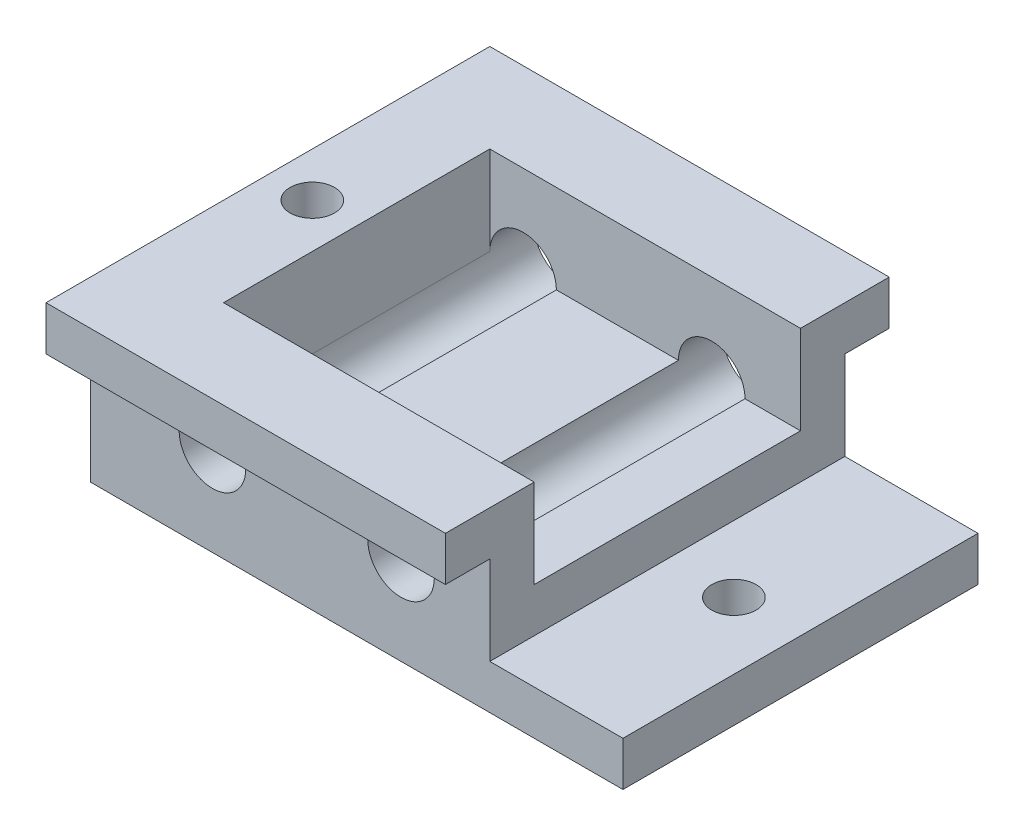
ISO-10303-21;
HEADER;
FILE_DESCRIPTION(('STEP AP214'),'2;1');
FILE_NAME('part.step','',(''),(''),'','','');
FILE_SCHEMA(('AUTOMOTIVE_DESIGN { 1 0 10303 214 1 1 1 1 }'));
ENDSEC;
DATA;
#1=APPLICATION_CONTEXT('core data for automotive mechanical design processes');
#2=APPLICATION_PROTOCOL_DEFINITION('international standard','automotive_design',2000,#1);
#3=PRODUCT_CONTEXT('',#1,'mechanical');
#4=PRODUCT('Part','Part','',(#3));
#5=PRODUCT_RELATED_PRODUCT_CATEGORY('part','',(#4));
#6=PRODUCT_DEFINITION_FORMATION('','',#4);
#7=PRODUCT_DEFINITION_CONTEXT('part definition',#1,'design');
#8=PRODUCT_DEFINITION('design','',#6,#7);
#9=PRODUCT_DEFINITION_SHAPE('','',#8);
#10=(LENGTH_UNIT() NAMED_UNIT(*) SI_UNIT(.MILLI.,.METRE.));
#11=(NAMED_UNIT(*) PLANE_ANGLE_UNIT() SI_UNIT($,.RADIAN.));
#12=(NAMED_UNIT(*) SI_UNIT($,.STERADIAN.) SOLID_ANGLE_UNIT());
#13=UNCERTAINTY_MEASURE_WITH_UNIT(LENGTH_MEASURE(1.E-05),#10,'distance_accuracy_value','');
#14=(GEOMETRIC_REPRESENTATION_CONTEXT(3) GLOBAL_UNCERTAINTY_ASSIGNED_CONTEXT((#13)) GLOBAL_UNIT_ASSIGNED_CONTEXT((#10,
#11,#12)) REPRESENTATION_CONTEXT('',''));
#15=CARTESIAN_POINT('',(0.,0.,0.));
#16=DIRECTION('',(0.,0.,1.));
#17=DIRECTION('',(1.,0.,0.));
#18=AXIS2_PLACEMENT_3D('',#15,#16,#17);
#19=CARTESIAN_POINT('',(0.,12.7,0.));
#20=DIRECTION('',(0.,1.,0.));
#21=DIRECTION('',(0.,0.,1.));
#22=AXIS2_PLACEMENT_3D('',#19,#20,#21);
#23=PLANE('',#22);
#24=DIRECTION('',(0.,0.,1.));
#25=VECTOR('',#24,1.);
#26=CARTESIAN_POINT('',(-15.875,12.7,-31.75));
#27=LINE('',#26,#25);
#28=CARTESIAN_POINT('',(-15.875,12.7,19.05));
#29=VERTEX_POINT('',#28);
#30=CARTESIAN_POINT('',(-15.875,12.7,-19.05));
#31=VERTEX_POINT('',#30);
#32=EDGE_CURVE('E64',#29,#31,#27,.F.);
#33=ORIENTED_EDGE('',*,*,#32,.F.);
#34=DIRECTION('',(-1.,0.,0.));
#35=VECTOR('',#34,1.);
#36=CARTESIAN_POINT('',(19.05,12.7,19.05));
#37=LINE('',#36,#35);
#38=CARTESIAN_POINT('',(1.5875,12.7,19.05));
#39=VERTEX_POINT('',#38);
#40=EDGE_CURVE('E171',#39,#29,#37,.T.);
#41=ORIENTED_EDGE('',*,*,#40,.F.);
#42=DIRECTION('',(0.,0.,1.));
#43=VECTOR('',#42,1.);
#44=CARTESIAN_POINT('',(1.5875,12.7,-31.75));
#45=LINE('',#44,#43);
#46=CARTESIAN_POINT('',(1.5875,12.7,-19.05));
#47=VERTEX_POINT('',#46);
#48=EDGE_CURVE('E159',#47,#39,#45,.T.);
#49=ORIENTED_EDGE('',*,*,#48,.F.);
#50=DIRECTION('',(1.,0.,0.));
#51=VECTOR('',#50,1.);
#52=CARTESIAN_POINT('',(-25.4,12.7,-19.05));
#53=LINE('',#52,#51);
#54=EDGE_CURVE('E169',#31,#47,#53,.T.);
#55=ORIENTED_EDGE('',*,*,#54,.F.);
#56=EDGE_LOOP('',(#33,#41,#49,#55));
#57=FACE_BOUND('',#56,.T.);
#58=ADVANCED_FACE('F40',(#57),#23,.T.);
#59=CARTESIAN_POINT('',(0.,6.35,0.));
#60=DIRECTION('',(0.,-1.,0.));
#61=DIRECTION('',(0.,0.,-1.));
#62=AXIS2_PLACEMENT_3D('',#59,#60,#61);
#63=PLANE('',#62);
#64=CARTESIAN_POINT('',(28.575,6.35,0.));
#65=DIRECTION('',(0.,-1.,0.));
#66=DIRECTION('',(0.,0.,-1.));
#67=AXIS2_PLACEMENT_3D('',#64,#65,#66);
#68=CIRCLE('',#67,3.175);
#69=CARTESIAN_POINT('',(28.575,6.35,-3.175));
#70=VERTEX_POINT('',#69);
#71=EDGE_CURVE('E343',#70,#70,#68,.F.);
#72=ORIENTED_EDGE('',*,*,#71,.F.);
#73=EDGE_LOOP('',(#72));
#74=FACE_BOUND('',#73,.T.);
#75=DIRECTION('',(0.,0.,-1.));
#76=VECTOR('',#75,1.);
#77=CARTESIAN_POINT('',(19.05,6.35,-25.4));
#78=LINE('',#77,#76);
#79=CARTESIAN_POINT('',(19.05,6.35,25.4));
#80=VERTEX_POINT('',#79);
#81=CARTESIAN_POINT('',(19.05,6.35,-25.4));
#82=VERTEX_POINT('',#81);
#83=EDGE_CURVE('E206',#80,#82,#78,.T.);
#84=ORIENTED_EDGE('',*,*,#83,.F.);
#85=DIRECTION('',(1.,0.,0.));
#86=VECTOR('',#85,1.);
#87=CARTESIAN_POINT('',(-38.1,6.35,25.4));
#88=LINE('',#87,#86);
#89=CARTESIAN_POINT('',(38.1,6.35,25.4));
#90=VERTEX_POINT('',#89);
#91=EDGE_CURVE('E223',#80,#90,#88,.T.);
#92=ORIENTED_EDGE('',*,*,#91,.T.);
#93=DIRECTION('',(0.,0.,-1.));
#94=VECTOR('',#93,1.);
#95=CARTESIAN_POINT('',(38.1,6.35,25.4));
#96=LINE('',#95,#94);
#97=CARTESIAN_POINT('',(38.1,6.35,-25.4));
#98=VERTEX_POINT('',#97);
#99=EDGE_CURVE('E226',#90,#98,#96,.T.);
#100=ORIENTED_EDGE('',*,*,#99,.T.);
#101=DIRECTION('',(-1.,0.,0.));
#102=VECTOR('',#101,1.);
#103=CARTESIAN_POINT('',(-38.1,6.35,-25.4));
#104=LINE('',#103,#102);
#105=EDGE_CURVE('E230',#98,#82,#104,.T.);
#106=ORIENTED_EDGE('',*,*,#105,.T.);
#107=EDGE_LOOP('',(#84,#92,#100,#106));
#108=FACE_BOUND('',#107,.T.);
#109=ADVANCED_FACE('F281',(#74,#108),#63,.F.);
#110=CARTESIAN_POINT('',(-38.1,6.35,25.4));
#111=DIRECTION('',(1.,0.,0.));
#112=DIRECTION('',(0.,0.,-1.));
#113=AXIS2_PLACEMENT_3D('',#110,#111,#112);
#114=PLANE('',#113);
#115=DIRECTION('',(0.,0.,1.));
#116=VECTOR('',#115,1.);
#117=CARTESIAN_POINT('',(-38.1,0.,25.4));
#118=LINE('',#117,#116);
#119=CARTESIAN_POINT('',(-38.1,0.,-25.4));
#120=VERTEX_POINT('',#119);
#121=CARTESIAN_POINT('',(-38.1,0.,25.4));
#122=VERTEX_POINT('',#121);
#123=EDGE_CURVE('E222',#120,#122,#118,.T.);
#124=ORIENTED_EDGE('',*,*,#123,.T.);
#125=DIRECTION('',(0.,-1.,0.));
#126=VECTOR('',#125,1.);
#127=CARTESIAN_POINT('',(-38.1,6.35,25.4));
#128=LINE('',#127,#126);
#129=CARTESIAN_POINT('',(-38.1,19.05,25.4));
#130=VERTEX_POINT('',#129);
#131=EDGE_CURVE('E165',#130,#122,#128,.T.);
#132=ORIENTED_EDGE('',*,*,#131,.F.);
#133=DIRECTION('',(0.,0.,1.));
#134=VECTOR('',#133,1.);
#135=CARTESIAN_POINT('',(-38.1,19.05,-31.75));
#136=LINE('',#135,#134);
#137=CARTESIAN_POINT('',(-38.1,19.05,31.75));
#138=VERTEX_POINT('',#137);
#139=EDGE_CURVE('E292',#130,#138,#136,.T.);
#140=ORIENTED_EDGE('',*,*,#139,.T.);
#141=DIRECTION('',(0.,-1.,0.));
#142=VECTOR('',#141,1.);
#143=CARTESIAN_POINT('',(-38.1,25.4,31.75));
#144=LINE('',#143,#142);
#145=CARTESIAN_POINT('',(-38.1,25.4,31.75));
#146=VERTEX_POINT('',#145);
#147=EDGE_CURVE('E318',#146,#138,#144,.T.);
#148=ORIENTED_EDGE('',*,*,#147,.F.);
#149=DIRECTION('',(0.,0.,1.));
#150=VECTOR('',#149,1.);
#151=CARTESIAN_POINT('',(-38.1,25.4,-31.75));
#152=LINE('',#151,#150);
#153=CARTESIAN_POINT('',(-38.1,25.4,-31.75));
#154=VERTEX_POINT('',#153);
#155=EDGE_CURVE('E358',#154,#146,#152,.T.);
#156=ORIENTED_EDGE('',*,*,#155,.F.);
#157=DIRECTION('',(0.,-1.,0.));
#158=VECTOR('',#157,1.);
#159=CARTESIAN_POINT('',(-38.1,25.4,-31.75));
#160=LINE('',#159,#158);
#161=CARTESIAN_POINT('',(-38.1,19.05,-31.75));
#162=VERTEX_POINT('',#161);
#163=EDGE_CURVE('E310',#154,#162,#160,.T.);
#164=ORIENTED_EDGE('',*,*,#163,.T.);
#165=CARTESIAN_POINT('',(-38.1,19.05,-25.4));
#166=VERTEX_POINT('',#165);
#167=EDGE_CURVE('E334',#162,#166,#136,.T.);
#168=ORIENTED_EDGE('',*,*,#167,.T.);
#169=DIRECTION('',(0.,-1.,0.));
#170=VECTOR('',#169,1.);
#171=CARTESIAN_POINT('',(-38.1,6.35,-25.4));
#172=LINE('',#171,#170);
#173=EDGE_CURVE('E233',#166,#120,#172,.T.);
#174=ORIENTED_EDGE('',*,*,#173,.T.);
#175=EDGE_LOOP('',(#124,#132,#140,#148,#156,#164,#168,#174));
#176=FACE_BOUND('',#175,.T.);
#177=ADVANCED_FACE('F42',(#176),#114,.F.);
#178=CARTESIAN_POINT('',(-38.1,6.35,25.4));
#179=DIRECTION('',(0.,0.,-1.));
#180=DIRECTION('',(-1.,0.,0.));
#181=AXIS2_PLACEMENT_3D('',#178,#179,#180);
#182=PLANE('',#181);
#183=CARTESIAN_POINT('',(-20.6375,12.7,25.4));
#184=DIRECTION('',(0.,0.,-1.));
#185=DIRECTION('',(-1.,0.,0.));
#186=AXIS2_PLACEMENT_3D('',#183,#184,#185);
#187=CIRCLE('',#186,4.7625);
#188=CARTESIAN_POINT('',(-25.4,12.7,25.4));
#189=VERTEX_POINT('',#188);
#190=EDGE_CURVE('E379',#189,#189,#187,.T.);
#191=ORIENTED_EDGE('',*,*,#190,.T.);
#192=EDGE_LOOP('',(#191));
#193=FACE_BOUND('',#192,.T.);
#194=CARTESIAN_POINT('',(6.35,12.7,25.4));
#195=DIRECTION('',(0.,0.,-1.));
#196=DIRECTION('',(-1.,0.,0.));
#197=AXIS2_PLACEMENT_3D('',#194,#195,#196);
#198=CIRCLE('',#197,4.7625);
#199=CARTESIAN_POINT('',(1.5875,12.7,25.4));
#200=VERTEX_POINT('',#199);
#201=EDGE_CURVE('E398',#200,#200,#198,.T.);
#202=ORIENTED_EDGE('',*,*,#201,.T.);
#203=EDGE_LOOP('',(#202));
#204=FACE_BOUND('',#203,.T.);
#205=DIRECTION('',(1.,0.,0.));
#206=VECTOR('',#205,1.);
#207=CARTESIAN_POINT('',(-38.1,0.,25.4));
#208=LINE('',#207,#206);
#209=CARTESIAN_POINT('',(38.1,0.,25.4));
#210=VERTEX_POINT('',#209);
#211=EDGE_CURVE('E237',#122,#210,#208,.T.);
#212=ORIENTED_EDGE('',*,*,#211,.T.);
#213=DIRECTION('',(0.,-1.,0.));
#214=VECTOR('',#213,1.);
#215=CARTESIAN_POINT('',(38.1,6.35,25.4));
#216=LINE('',#215,#214);
#217=EDGE_CURVE('E252',#90,#210,#216,.T.);
#218=ORIENTED_EDGE('',*,*,#217,.F.);
#219=ORIENTED_EDGE('',*,*,#91,.F.);
#220=DIRECTION('',(0.,-1.,0.));
#221=VECTOR('',#220,1.);
#222=CARTESIAN_POINT('',(19.05,12.7,25.4));
#223=LINE('',#222,#221);
#224=CARTESIAN_POINT('',(19.05,19.05,25.4));
#225=VERTEX_POINT('',#224);
#226=EDGE_CURVE('E218',#225,#80,#223,.T.);
#227=ORIENTED_EDGE('',*,*,#226,.F.);
#228=DIRECTION('',(1.,0.,0.));
#229=VECTOR('',#228,1.);
#230=CARTESIAN_POINT('',(-38.1,19.05,25.4));
#231=LINE('',#230,#229);
#232=EDGE_CURVE('E185',#130,#225,#231,.T.);
#233=ORIENTED_EDGE('',*,*,#232,.F.);
#234=ORIENTED_EDGE('',*,*,#131,.T.);
#235=EDGE_LOOP('',(#212,#218,#219,#227,#233,#234));
#236=FACE_BOUND('',#235,.T.);
#237=ADVANCED_FACE('F261',(#193,#204,#236),#182,.F.);
#238=CARTESIAN_POINT('',(38.1,6.35,25.4));
#239=DIRECTION('',(-1.,0.,0.));
#240=DIRECTION('',(0.,0.,1.));
#241=AXIS2_PLACEMENT_3D('',#238,#239,#240);
#242=PLANE('',#241);
#243=DIRECTION('',(0.,0.,-1.));
#244=VECTOR('',#243,1.);
#245=CARTESIAN_POINT('',(38.1,0.,25.4));
#246=LINE('',#245,#244);
#247=CARTESIAN_POINT('',(38.1,0.,-25.4));
#248=VERTEX_POINT('',#247);
#249=EDGE_CURVE('E240',#210,#248,#246,.T.);
#250=ORIENTED_EDGE('',*,*,#249,.T.);
#251=DIRECTION('',(0.,-1.,0.));
#252=VECTOR('',#251,1.);
#253=CARTESIAN_POINT('',(38.1,6.35,-25.4));
#254=LINE('',#253,#252);
#255=EDGE_CURVE('E248',#98,#248,#254,.T.);
#256=ORIENTED_EDGE('',*,*,#255,.F.);
#257=ORIENTED_EDGE('',*,*,#99,.F.);
#258=ORIENTED_EDGE('',*,*,#217,.T.);
#259=EDGE_LOOP('',(#250,#256,#257,#258));
#260=FACE_BOUND('',#259,.T.);
#261=ADVANCED_FACE('F274',(#260),#242,.F.);
#262=CARTESIAN_POINT('',(-38.1,6.35,-25.4));
#263=DIRECTION('',(0.,0.,1.));
#264=DIRECTION('',(1.,0.,0.));
#265=AXIS2_PLACEMENT_3D('',#262,#263,#264);
#266=PLANE('',#265);
#267=CARTESIAN_POINT('',(-20.6375,12.7,-25.4));
#268=DIRECTION('',(0.,0.,1.));
#269=DIRECTION('',(1.,0.,0.));
#270=AXIS2_PLACEMENT_3D('',#267,#268,#269);
#271=CIRCLE('',#270,4.7625);
#272=CARTESIAN_POINT('',(-15.875,12.7,-25.4));
#273=VERTEX_POINT('',#272);
#274=EDGE_CURVE('E389',#273,#273,#271,.T.);
#275=ORIENTED_EDGE('',*,*,#274,.T.);
#276=EDGE_LOOP('',(#275));
#277=FACE_BOUND('',#276,.T.);
#278=CARTESIAN_POINT('',(6.35,12.7,-25.4));
#279=DIRECTION('',(0.,0.,1.));
#280=DIRECTION('',(1.,0.,0.));
#281=AXIS2_PLACEMENT_3D('',#278,#279,#280);
#282=CIRCLE('',#281,4.7625);
#283=CARTESIAN_POINT('',(11.1125,12.7,-25.4));
#284=VERTEX_POINT('',#283);
#285=EDGE_CURVE('E402',#284,#284,#282,.T.);
#286=ORIENTED_EDGE('',*,*,#285,.T.);
#287=EDGE_LOOP('',(#286));
#288=FACE_BOUND('',#287,.T.);
#289=DIRECTION('',(-1.,0.,0.));
#290=VECTOR('',#289,1.);
#291=CARTESIAN_POINT('',(-38.1,0.,-25.4));
#292=LINE('',#291,#290);
#293=EDGE_CURVE('E227',#248,#120,#292,.T.);
#294=ORIENTED_EDGE('',*,*,#293,.T.);
#295=ORIENTED_EDGE('',*,*,#173,.F.);
#296=DIRECTION('',(-1.,0.,0.));
#297=VECTOR('',#296,1.);
#298=CARTESIAN_POINT('',(19.05,19.05,-25.4));
#299=LINE('',#298,#297);
#300=CARTESIAN_POINT('',(19.05,19.05,-25.4));
#301=VERTEX_POINT('',#300);
#302=EDGE_CURVE('E178',#301,#166,#299,.T.);
#303=ORIENTED_EDGE('',*,*,#302,.F.);
#304=DIRECTION('',(0.,-1.,0.));
#305=VECTOR('',#304,1.);
#306=CARTESIAN_POINT('',(19.05,12.7,-25.4));
#307=LINE('',#306,#305);
#308=EDGE_CURVE('E211',#301,#82,#307,.T.);
#309=ORIENTED_EDGE('',*,*,#308,.T.);
#310=ORIENTED_EDGE('',*,*,#105,.F.);
#311=ORIENTED_EDGE('',*,*,#255,.T.);
#312=EDGE_LOOP('',(#294,#295,#303,#309,#310,#311));
#313=FACE_BOUND('',#312,.T.);
#314=ADVANCED_FACE('F278',(#277,#288,#313),#266,.F.);
#315=CARTESIAN_POINT('',(0.,0.,0.));
#316=DIRECTION('',(0.,-1.,0.));
#317=DIRECTION('',(0.,0.,-1.));
#318=AXIS2_PLACEMENT_3D('',#315,#316,#317);
#319=PLANE('',#318);
#320=CARTESIAN_POINT('',(-31.75,0.,0.));
#321=DIRECTION('',(0.,1.,0.));
#322=DIRECTION('',(0.,0.,1.));
#323=AXIS2_PLACEMENT_3D('',#320,#321,#322);
#324=CIRCLE('',#323,3.175);
#325=CARTESIAN_POINT('',(-31.75,0.,3.175));
#326=VERTEX_POINT('',#325);
#327=EDGE_CURVE('E378',#326,#326,#324,.T.);
#328=ORIENTED_EDGE('',*,*,#327,.T.);
#329=EDGE_LOOP('',(#328));
#330=FACE_BOUND('',#329,.T.);
#331=CARTESIAN_POINT('',(28.575,0.,0.));
#332=DIRECTION('',(0.,1.,0.));
#333=DIRECTION('',(0.,0.,1.));
#334=AXIS2_PLACEMENT_3D('',#331,#332,#333);
#335=CIRCLE('',#334,3.175);
#336=CARTESIAN_POINT('',(28.575,0.,3.175));
#337=VERTEX_POINT('',#336);
#338=EDGE_CURVE('E374',#337,#337,#335,.T.);
#339=ORIENTED_EDGE('',*,*,#338,.T.);
#340=EDGE_LOOP('',(#339));
#341=FACE_BOUND('',#340,.T.);
#342=ORIENTED_EDGE('',*,*,#123,.F.);
#343=ORIENTED_EDGE('',*,*,#293,.F.);
#344=ORIENTED_EDGE('',*,*,#249,.F.);
#345=ORIENTED_EDGE('',*,*,#211,.F.);
#346=EDGE_LOOP('',(#342,#343,#344,#345));
#347=FACE_BOUND('',#346,.T.);
#348=ADVANCED_FACE('F270',(#330,#341,#347),#319,.T.);
#349=CARTESIAN_POINT('',(19.05,12.7,-25.4));
#350=DIRECTION('',(-1.,0.,0.));
#351=DIRECTION('',(0.,0.,1.));
#352=AXIS2_PLACEMENT_3D('',#349,#350,#351);
#353=PLANE('',#352);
#354=ORIENTED_EDGE('',*,*,#83,.T.);
#355=ORIENTED_EDGE('',*,*,#308,.F.);
#356=DIRECTION('',(0.,0.,-1.));
#357=VECTOR('',#356,1.);
#358=CARTESIAN_POINT('',(19.05,19.05,-19.05));
#359=LINE('',#358,#357);
#360=CARTESIAN_POINT('',(19.05,19.05,-31.75));
#361=VERTEX_POINT('',#360);
#362=EDGE_CURVE('E340',#301,#361,#359,.T.);
#363=ORIENTED_EDGE('',*,*,#362,.T.);
#364=DIRECTION('',(0.,-1.,0.));
#365=VECTOR('',#364,1.);
#366=CARTESIAN_POINT('',(19.05,25.4,-31.75));
#367=LINE('',#366,#365);
#368=CARTESIAN_POINT('',(19.05,25.4,-31.75));
#369=VERTEX_POINT('',#368);
#370=EDGE_CURVE('E305',#369,#361,#367,.T.);
#371=ORIENTED_EDGE('',*,*,#370,.F.);
#372=DIRECTION('',(0.,0.,-1.));
#373=VECTOR('',#372,1.);
#374=CARTESIAN_POINT('',(19.05,25.4,-19.05));
#375=LINE('',#374,#373);
#376=CARTESIAN_POINT('',(19.05,25.4,-19.05));
#377=VERTEX_POINT('',#376);
#378=EDGE_CURVE('E364',#377,#369,#375,.T.);
#379=ORIENTED_EDGE('',*,*,#378,.F.);
#380=DIRECTION('',(0.,-1.,0.));
#381=VECTOR('',#380,1.);
#382=CARTESIAN_POINT('',(19.05,19.05,-19.05));
#383=LINE('',#382,#381);
#384=CARTESIAN_POINT('',(19.05,12.7,-19.05));
#385=VERTEX_POINT('',#384);
#386=EDGE_CURVE('E191',#377,#385,#383,.T.);
#387=ORIENTED_EDGE('',*,*,#386,.T.);
#388=DIRECTION('',(0.,0.,-1.));
#389=VECTOR('',#388,1.);
#390=CARTESIAN_POINT('',(19.05,12.7,-25.4));
#391=LINE('',#390,#389);
#392=CARTESIAN_POINT('',(19.05,12.7,19.05));
#393=VERTEX_POINT('',#392);
#394=EDGE_CURVE('E207',#393,#385,#391,.T.);
#395=ORIENTED_EDGE('',*,*,#394,.F.);
#396=DIRECTION('',(0.,-1.,0.));
#397=VECTOR('',#396,1.);
#398=CARTESIAN_POINT('',(19.05,19.05,19.05));
#399=LINE('',#398,#397);
#400=CARTESIAN_POINT('',(19.05,25.4,19.05));
#401=VERTEX_POINT('',#400);
#402=EDGE_CURVE('E202',#401,#393,#399,.T.);
#403=ORIENTED_EDGE('',*,*,#402,.F.);
#404=DIRECTION('',(0.,0.,-1.));
#405=VECTOR('',#404,1.);
#406=CARTESIAN_POINT('',(19.05,25.4,31.75));
#407=LINE('',#406,#405);
#408=CARTESIAN_POINT('',(19.05,25.4,31.75));
#409=VERTEX_POINT('',#408);
#410=EDGE_CURVE('E351',#409,#401,#407,.T.);
#411=ORIENTED_EDGE('',*,*,#410,.F.);
#412=DIRECTION('',(0.,-1.,0.));
#413=VECTOR('',#412,1.);
#414=CARTESIAN_POINT('',(19.05,25.4,31.75));
#415=LINE('',#414,#413);
#416=CARTESIAN_POINT('',(19.05,19.05,31.75));
#417=VERTEX_POINT('',#416);
#418=EDGE_CURVE('E324',#409,#417,#415,.T.);
#419=ORIENTED_EDGE('',*,*,#418,.T.);
#420=DIRECTION('',(0.,0.,-1.));
#421=VECTOR('',#420,1.);
#422=CARTESIAN_POINT('',(19.05,19.05,31.75));
#423=LINE('',#422,#421);
#424=EDGE_CURVE('E288',#417,#225,#423,.T.);
#425=ORIENTED_EDGE('',*,*,#424,.T.);
#426=ORIENTED_EDGE('',*,*,#226,.T.);
#427=EDGE_LOOP('',(#354,#355,#363,#371,#379,#387,#395,#403,#411,#419,#425,#426));
#428=FACE_BOUND('',#427,.T.);
#429=ADVANCED_FACE('F284',(#428),#353,.F.);
#430=DIRECTION('',(0.,0.,1.));
#431=VECTOR('',#430,1.);
#432=CARTESIAN_POINT('',(11.1125,12.7,-31.75));
#433=LINE('',#432,#431);
#434=CARTESIAN_POINT('',(11.1125,12.7,19.05));
#435=VERTEX_POINT('',#434);
#436=CARTESIAN_POINT('',(11.1125,12.7,-19.05));
#437=VERTEX_POINT('',#436);
#438=EDGE_CURVE('E56',#435,#437,#433,.F.);
#439=ORIENTED_EDGE('',*,*,#438,.F.);
#440=EDGE_CURVE('E297',#393,#435,#37,.T.);
#441=ORIENTED_EDGE('',*,*,#440,.F.);
#442=ORIENTED_EDGE('',*,*,#394,.T.);
#443=EDGE_CURVE('E179',#437,#385,#53,.T.);
#444=ORIENTED_EDGE('',*,*,#443,.F.);
#445=EDGE_LOOP('',(#439,#441,#442,#444));
#446=FACE_BOUND('',#445,.T.);
#447=ADVANCED_FACE('F468',(#446),#23,.T.);
#448=CARTESIAN_POINT('',(19.05,19.05,19.05));
#449=DIRECTION('',(0.,0.,1.));
#450=DIRECTION('',(1.,0.,0.));
#451=AXIS2_PLACEMENT_3D('',#448,#449,#450);
#452=PLANE('',#451);
#453=ORIENTED_EDGE('',*,*,#40,.T.);
#454=CARTESIAN_POINT('',(-20.6375,12.7,19.05));
#455=DIRECTION('',(0.,0.,1.));
#456=DIRECTION('',(1.,0.,0.));
#457=AXIS2_PLACEMENT_3D('',#454,#455,#456);
#458=CIRCLE('',#457,4.7625);
#459=CARTESIAN_POINT('',(-25.4,12.7,19.05));
#460=VERTEX_POINT('',#459);
#461=EDGE_CURVE('E395',#29,#460,#458,.T.);
#462=ORIENTED_EDGE('',*,*,#461,.T.);
#463=DIRECTION('',(0.,-1.,0.));
#464=VECTOR('',#463,1.);
#465=CARTESIAN_POINT('',(-25.4,19.05,19.05));
#466=LINE('',#465,#464);
#467=CARTESIAN_POINT('',(-25.4,25.4,19.05));
#468=VERTEX_POINT('',#467);
#469=EDGE_CURVE('E198',#468,#460,#466,.T.);
#470=ORIENTED_EDGE('',*,*,#469,.F.);
#471=DIRECTION('',(-1.,0.,0.));
#472=VECTOR('',#471,1.);
#473=CARTESIAN_POINT('',(19.05,25.4,19.05));
#474=LINE('',#473,#472);
#475=EDGE_CURVE('E347',#401,#468,#474,.T.);
#476=ORIENTED_EDGE('',*,*,#475,.F.);
#477=ORIENTED_EDGE('',*,*,#402,.T.);
#478=ORIENTED_EDGE('',*,*,#440,.T.);
#479=CARTESIAN_POINT('',(6.35,12.7,19.05));
#480=DIRECTION('',(0.,0.,1.));
#481=DIRECTION('',(1.,0.,0.));
#482=AXIS2_PLACEMENT_3D('',#479,#480,#481);
#483=CIRCLE('',#482,4.7625);
#484=EDGE_CURVE('E173',#435,#39,#483,.T.);
#485=ORIENTED_EDGE('',*,*,#484,.T.);
#486=EDGE_LOOP('',(#453,#462,#470,#476,#477,#478,#485));
#487=FACE_BOUND('',#486,.T.);
#488=ADVANCED_FACE('F477',(#487),#452,.F.);
#489=CARTESIAN_POINT('',(-25.4,19.05,19.05));
#490=DIRECTION('',(-1.,0.,0.));
#491=DIRECTION('',(0.,0.,1.));
#492=AXIS2_PLACEMENT_3D('',#489,#490,#491);
#493=PLANE('',#492);
#494=DIRECTION('',(0.,0.,-1.));
#495=VECTOR('',#494,1.);
#496=CARTESIAN_POINT('',(-25.4,12.7,19.05));
#497=LINE('',#496,#495);
#498=CARTESIAN_POINT('',(-25.4,12.7,-19.05));
#499=VERTEX_POINT('',#498);
#500=EDGE_CURVE('E187',#460,#499,#497,.T.);
#501=ORIENTED_EDGE('',*,*,#500,.T.);
#502=DIRECTION('',(0.,-1.,0.));
#503=VECTOR('',#502,1.);
#504=CARTESIAN_POINT('',(-25.4,19.05,-19.05));
#505=LINE('',#504,#503);
#506=CARTESIAN_POINT('',(-25.4,25.4,-19.05));
#507=VERTEX_POINT('',#506);
#508=EDGE_CURVE('E195',#507,#499,#505,.T.);
#509=ORIENTED_EDGE('',*,*,#508,.F.);
#510=DIRECTION('',(0.,0.,-1.));
#511=VECTOR('',#510,1.);
#512=CARTESIAN_POINT('',(-25.4,25.4,19.05));
#513=LINE('',#512,#511);
#514=EDGE_CURVE('E327',#468,#507,#513,.T.);
#515=ORIENTED_EDGE('',*,*,#514,.F.);
#516=ORIENTED_EDGE('',*,*,#469,.T.);
#517=EDGE_LOOP('',(#501,#509,#515,#516));
#518=FACE_BOUND('',#517,.T.);
#519=ADVANCED_FACE('F483',(#518),#493,.F.);
#520=CARTESIAN_POINT('',(-25.4,19.05,-19.05));
#521=DIRECTION('',(0.,0.,-1.));
#522=DIRECTION('',(-1.,0.,0.));
#523=AXIS2_PLACEMENT_3D('',#520,#521,#522);
#524=PLANE('',#523);
#525=ORIENTED_EDGE('',*,*,#508,.T.);
#526=CARTESIAN_POINT('',(-20.6375,12.7,-19.05));
#527=DIRECTION('',(0.,0.,-1.));
#528=DIRECTION('',(-1.,0.,0.));
#529=AXIS2_PLACEMENT_3D('',#526,#527,#528);
#530=CIRCLE('',#529,4.7625);
#531=EDGE_CURVE('E11',#499,#31,#530,.T.);
#532=ORIENTED_EDGE('',*,*,#531,.T.);
#533=ORIENTED_EDGE('',*,*,#54,.T.);
#534=CARTESIAN_POINT('',(6.35,12.7,-19.05));
#535=DIRECTION('',(0.,0.,-1.));
#536=DIRECTION('',(-1.,0.,0.));
#537=AXIS2_PLACEMENT_3D('',#534,#535,#536);
#538=CIRCLE('',#537,4.7625);
#539=EDGE_CURVE('E49',#47,#437,#538,.T.);
#540=ORIENTED_EDGE('',*,*,#539,.T.);
#541=ORIENTED_EDGE('',*,*,#443,.T.);
#542=ORIENTED_EDGE('',*,*,#386,.F.);
#543=DIRECTION('',(1.,0.,0.));
#544=VECTOR('',#543,1.);
#545=CARTESIAN_POINT('',(-25.4,25.4,-19.05));
#546=LINE('',#545,#544);
#547=EDGE_CURVE('E330',#507,#377,#546,.T.);
#548=ORIENTED_EDGE('',*,*,#547,.F.);
#549=EDGE_LOOP('',(#525,#532,#533,#540,#541,#542,#548));
#550=FACE_BOUND('',#549,.T.);
#551=ADVANCED_FACE('F176',(#550),#524,.F.);
#552=CARTESIAN_POINT('',(0.,19.05,0.));
#553=DIRECTION('',(0.,1.,0.));
#554=DIRECTION('',(0.,0.,1.));
#555=AXIS2_PLACEMENT_3D('',#552,#553,#554);
#556=PLANE('',#555);
#557=ORIENTED_EDGE('',*,*,#362,.F.);
#558=ORIENTED_EDGE('',*,*,#302,.T.);
#559=ORIENTED_EDGE('',*,*,#167,.F.);
#560=DIRECTION('',(-1.,0.,0.));
#561=VECTOR('',#560,1.);
#562=CARTESIAN_POINT('',(19.05,19.05,-31.75));
#563=LINE('',#562,#561);
#564=EDGE_CURVE('E337',#361,#162,#563,.T.);
#565=ORIENTED_EDGE('',*,*,#564,.F.);
#566=EDGE_LOOP('',(#557,#558,#559,#565));
#567=FACE_BOUND('',#566,.T.);
#568=ADVANCED_FACE('F454',(#567),#556,.F.);
#569=ORIENTED_EDGE('',*,*,#139,.F.);
#570=ORIENTED_EDGE('',*,*,#232,.T.);
#571=ORIENTED_EDGE('',*,*,#424,.F.);
#572=DIRECTION('',(1.,0.,0.));
#573=VECTOR('',#572,1.);
#574=CARTESIAN_POINT('',(-38.1,19.05,31.75));
#575=LINE('',#574,#573);
#576=EDGE_CURVE('E331',#138,#417,#575,.T.);
#577=ORIENTED_EDGE('',*,*,#576,.F.);
#578=EDGE_LOOP('',(#569,#570,#571,#577));
#579=FACE_BOUND('',#578,.T.);
#580=ADVANCED_FACE('F290',(#579),#556,.F.);
#581=CARTESIAN_POINT('',(19.05,25.4,-31.75));
#582=DIRECTION('',(0.,0.,1.));
#583=DIRECTION('',(1.,0.,0.));
#584=AXIS2_PLACEMENT_3D('',#581,#582,#583);
#585=PLANE('',#584);
#586=ORIENTED_EDGE('',*,*,#564,.T.);
#587=ORIENTED_EDGE('',*,*,#163,.F.);
#588=DIRECTION('',(-1.,0.,0.));
#589=VECTOR('',#588,1.);
#590=CARTESIAN_POINT('',(19.05,25.4,-31.75));
#591=LINE('',#590,#589);
#592=EDGE_CURVE('E361',#369,#154,#591,.T.);
#593=ORIENTED_EDGE('',*,*,#592,.F.);
#594=ORIENTED_EDGE('',*,*,#370,.T.);
#595=EDGE_LOOP('',(#586,#587,#593,#594));
#596=FACE_BOUND('',#595,.T.);
#597=ADVANCED_FACE('F456',(#596),#585,.F.);
#598=CARTESIAN_POINT('',(-38.1,25.4,31.75));
#599=DIRECTION('',(0.,0.,-1.));
#600=DIRECTION('',(-1.,0.,0.));
#601=AXIS2_PLACEMENT_3D('',#598,#599,#600);
#602=PLANE('',#601);
#603=ORIENTED_EDGE('',*,*,#576,.T.);
#604=ORIENTED_EDGE('',*,*,#418,.F.);
#605=DIRECTION('',(1.,0.,0.));
#606=VECTOR('',#605,1.);
#607=CARTESIAN_POINT('',(-38.1,25.4,31.75));
#608=LINE('',#607,#606);
#609=EDGE_CURVE('E355',#146,#409,#608,.T.);
#610=ORIENTED_EDGE('',*,*,#609,.F.);
#611=ORIENTED_EDGE('',*,*,#147,.T.);
#612=EDGE_LOOP('',(#603,#604,#610,#611));
#613=FACE_BOUND('',#612,.T.);
#614=ADVANCED_FACE('F444',(#613),#602,.F.);
#615=CARTESIAN_POINT('',(0.,25.4,0.));
#616=DIRECTION('',(0.,1.,0.));
#617=DIRECTION('',(0.,0.,1.));
#618=AXIS2_PLACEMENT_3D('',#615,#616,#617);
#619=PLANE('',#618);
#620=CARTESIAN_POINT('',(-31.75,25.4,0.));
#621=DIRECTION('',(0.,1.,0.));
#622=DIRECTION('',(0.,0.,1.));
#623=AXIS2_PLACEMENT_3D('',#620,#621,#622);
#624=CIRCLE('',#623,3.175);
#625=CARTESIAN_POINT('',(-31.75,25.4,3.175));
#626=VERTEX_POINT('',#625);
#627=EDGE_CURVE('E373',#626,#626,#624,.T.);
#628=ORIENTED_EDGE('',*,*,#627,.F.);
#629=EDGE_LOOP('',(#628));
#630=FACE_BOUND('',#629,.T.);
#631=ORIENTED_EDGE('',*,*,#547,.T.);
#632=ORIENTED_EDGE('',*,*,#378,.T.);
#633=ORIENTED_EDGE('',*,*,#592,.T.);
#634=ORIENTED_EDGE('',*,*,#155,.T.);
#635=ORIENTED_EDGE('',*,*,#609,.T.);
#636=ORIENTED_EDGE('',*,*,#410,.T.);
#637=ORIENTED_EDGE('',*,*,#475,.T.);
#638=ORIENTED_EDGE('',*,*,#514,.T.);
#639=EDGE_LOOP('',(#631,#632,#633,#634,#635,#636,#637,#638));
#640=FACE_BOUND('',#639,.T.);
#641=ADVANCED_FACE('F448',(#630,#640),#619,.T.);
#642=CARTESIAN_POINT('',(-31.75,25.4,0.));
#643=DIRECTION('',(0.,-1.,0.));
#644=DIRECTION('',(0.,0.,-1.));
#645=AXIS2_PLACEMENT_3D('',#642,#643,#644);
#646=CYLINDRICAL_SURFACE('',#645,3.175);
#647=ORIENTED_EDGE('',*,*,#627,.T.);
#648=EDGE_LOOP('',(#647));
#649=FACE_BOUND('',#648,.T.);
#650=ORIENTED_EDGE('',*,*,#327,.F.);
#651=EDGE_LOOP('',(#650));
#652=FACE_BOUND('',#651,.T.);
#653=ADVANCED_FACE('F505',(#649,#652),#646,.F.);
#654=CARTESIAN_POINT('',(28.575,25.4,0.));
#655=DIRECTION('',(0.,-1.,0.));
#656=DIRECTION('',(0.,0.,-1.));
#657=AXIS2_PLACEMENT_3D('',#654,#655,#656);
#658=CYLINDRICAL_SURFACE('',#657,3.175);
#659=ORIENTED_EDGE('',*,*,#338,.F.);
#660=EDGE_LOOP('',(#659));
#661=FACE_BOUND('',#660,.T.);
#662=ORIENTED_EDGE('',*,*,#71,.T.);
#663=EDGE_LOOP('',(#662));
#664=FACE_BOUND('',#663,.T.);
#665=ADVANCED_FACE('F499',(#661,#664),#658,.F.);
#666=CARTESIAN_POINT('',(6.35,12.7,-31.75));
#667=DIRECTION('',(0.,0.,1.));
#668=DIRECTION('',(1.,0.,0.));
#669=AXIS2_PLACEMENT_3D('',#666,#667,#668);
#670=CYLINDRICAL_SURFACE('',#669,4.7625);
#671=ORIENTED_EDGE('',*,*,#285,.F.);
#672=EDGE_LOOP('',(#671));
#673=FACE_BOUND('',#672,.T.);
#674=ORIENTED_EDGE('',*,*,#438,.T.);
#675=ORIENTED_EDGE('',*,*,#539,.F.);
#676=ORIENTED_EDGE('',*,*,#48,.T.);
#677=ORIENTED_EDGE('',*,*,#484,.F.);
#678=EDGE_LOOP('',(#674,#675,#676,#677));
#679=FACE_BOUND('',#678,.T.);
#680=ORIENTED_EDGE('',*,*,#201,.F.);
#681=EDGE_LOOP('',(#680));
#682=FACE_BOUND('',#681,.T.);
#683=ADVANCED_FACE('F157',(#673,#679,#682),#670,.F.);
#684=CARTESIAN_POINT('',(-20.6375,12.7,-31.75));
#685=DIRECTION('',(0.,0.,1.));
#686=DIRECTION('',(1.,0.,0.));
#687=AXIS2_PLACEMENT_3D('',#684,#685,#686);
#688=CYLINDRICAL_SURFACE('',#687,4.7625);
#689=ORIENTED_EDGE('',*,*,#274,.F.);
#690=EDGE_LOOP('',(#689));
#691=FACE_BOUND('',#690,.T.);
#692=ORIENTED_EDGE('',*,*,#32,.T.);
#693=ORIENTED_EDGE('',*,*,#531,.F.);
#694=ORIENTED_EDGE('',*,*,#500,.F.);
#695=ORIENTED_EDGE('',*,*,#461,.F.);
#696=EDGE_LOOP('',(#692,#693,#694,#695));
#697=FACE_BOUND('',#696,.T.);
#698=ORIENTED_EDGE('',*,*,#190,.F.);
#699=EDGE_LOOP('',(#698));
#700=FACE_BOUND('',#699,.T.);
#701=ADVANCED_FACE('F488',(#691,#697,#700),#688,.F.);
#702=CLOSED_SHELL('',(#58,#109,#177,#237,#261,#314,#348,#429,#447,#488,#519,#551,#568,#580,#597,
#614,#641,#653,#665,#683,#701));
#703=MANIFOLD_SOLID_BREP('B2',#702);
#704=ADVANCED_BREP_SHAPE_REPRESENTATION('',(#18,#703),#14);
#705=SHAPE_DEFINITION_REPRESENTATION(#9,#704);
ENDSEC;
END-ISO-10303-21;
